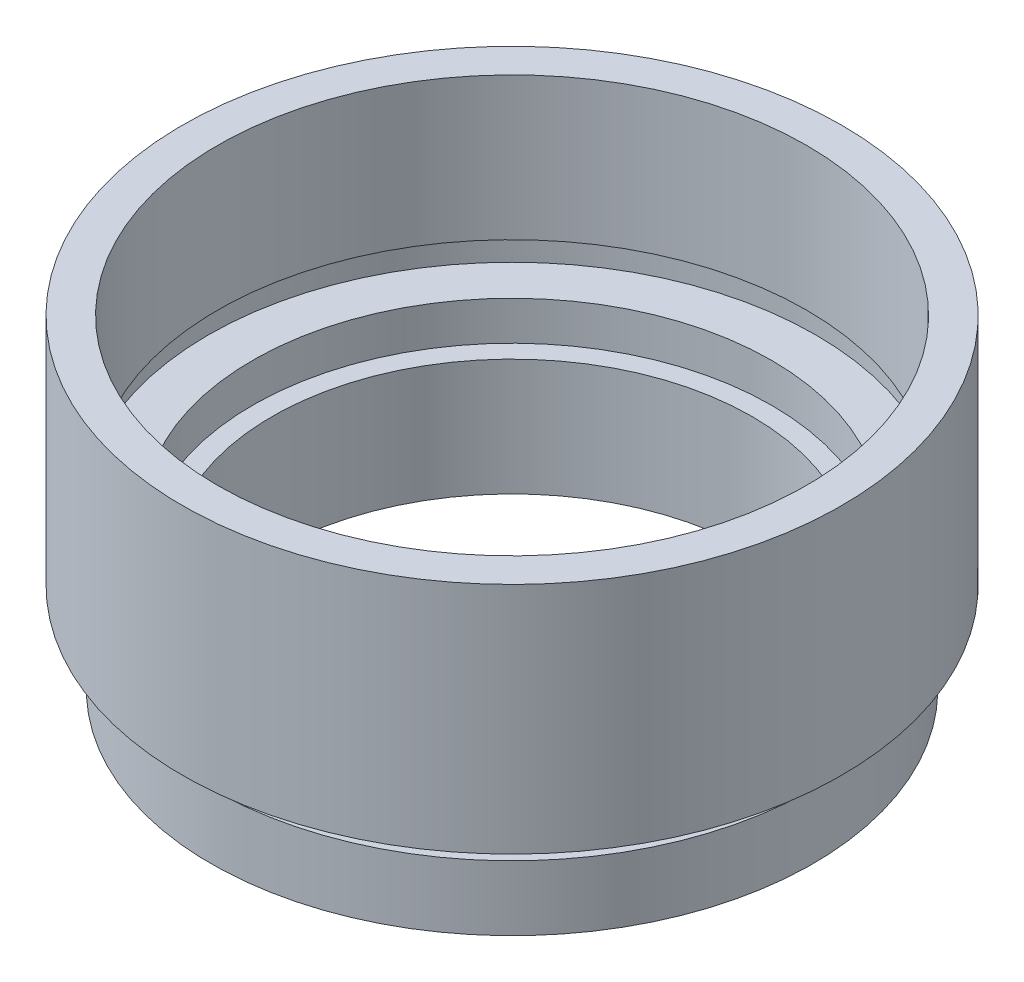
ISO-10303-21;
HEADER;
FILE_DESCRIPTION(('STEP AP214'),'2;1');
FILE_NAME('part.step','',(''),(''),'','','');
FILE_SCHEMA(('AUTOMOTIVE_DESIGN { 1 0 10303 214 1 1 1 1 }'));
ENDSEC;
DATA;
#1=APPLICATION_CONTEXT('core data for automotive mechanical design processes');
#2=APPLICATION_PROTOCOL_DEFINITION('international standard','automotive_design',2000,#1);
#3=PRODUCT_CONTEXT('',#1,'mechanical');
#4=PRODUCT('Part','Part','',(#3));
#5=PRODUCT_RELATED_PRODUCT_CATEGORY('part','',(#4));
#6=PRODUCT_DEFINITION_FORMATION('','',#4);
#7=PRODUCT_DEFINITION_CONTEXT('part definition',#1,'design');
#8=PRODUCT_DEFINITION('design','',#6,#7);
#9=PRODUCT_DEFINITION_SHAPE('','',#8);
#10=(LENGTH_UNIT() NAMED_UNIT(*) SI_UNIT(.MILLI.,.METRE.));
#11=(NAMED_UNIT(*) PLANE_ANGLE_UNIT() SI_UNIT($,.RADIAN.));
#12=(NAMED_UNIT(*) SI_UNIT($,.STERADIAN.) SOLID_ANGLE_UNIT());
#13=UNCERTAINTY_MEASURE_WITH_UNIT(LENGTH_MEASURE(1.E-05),#10,'distance_accuracy_value','');
#14=(GEOMETRIC_REPRESENTATION_CONTEXT(3) GLOBAL_UNCERTAINTY_ASSIGNED_CONTEXT((#13)) GLOBAL_UNIT_ASSIGNED_CONTEXT((#10,
#11,#12)) REPRESENTATION_CONTEXT('',''));
#15=CARTESIAN_POINT('',(0.,0.,0.));
#16=DIRECTION('',(0.,0.,1.));
#17=DIRECTION('',(1.,0.,0.));
#18=AXIS2_PLACEMENT_3D('',#15,#16,#17);
#19=CARTESIAN_POINT('',(0.,0.,0.));
#20=DIRECTION('',(0.,-1.,0.));
#21=DIRECTION('',(0.,0.,-1.));
#22=AXIS2_PLACEMENT_3D('',#19,#20,#21);
#23=CYLINDRICAL_SURFACE('',#22,9.25);
#24=CARTESIAN_POINT('',(0.,0.,0.));
#25=DIRECTION('',(0.,-1.,0.));
#26=DIRECTION('',(0.,0.,-1.));
#27=AXIS2_PLACEMENT_3D('',#24,#25,#26);
#28=CIRCLE('',#27,9.25);
#29=CARTESIAN_POINT('',(0.,0.,-9.25));
#30=VERTEX_POINT('',#29);
#31=EDGE_CURVE('E10',#30,#30,#28,.T.);
#32=ORIENTED_EDGE('',*,*,#31,.T.);
#33=EDGE_LOOP('',(#32));
#34=FACE_BOUND('',#33,.T.);
#35=CARTESIAN_POINT('',(0.,4.5,0.));
#36=DIRECTION('',(0.,-1.,0.));
#37=DIRECTION('',(0.,0.,-1.));
#38=AXIS2_PLACEMENT_3D('',#35,#36,#37);
#39=CIRCLE('',#38,9.25);
#40=CARTESIAN_POINT('',(0.,4.5,-9.25));
#41=VERTEX_POINT('',#40);
#42=EDGE_CURVE('E80',#41,#41,#39,.T.);
#43=ORIENTED_EDGE('',*,*,#42,.F.);
#44=EDGE_LOOP('',(#43));
#45=FACE_BOUND('',#44,.T.);
#46=ADVANCED_FACE('F34',(#34,#45),#23,.F.);
#47=CARTESIAN_POINT('',(9.25,0.,0.));
#48=DIRECTION('',(0.,-1.,0.));
#49=DIRECTION('',(0.,0.,-1.));
#50=AXIS2_PLACEMENT_3D('',#47,#48,#49);
#51=PLANE('',#50);
#52=CARTESIAN_POINT('',(0.,0.,0.));
#53=DIRECTION('',(0.,-1.,0.));
#54=DIRECTION('',(0.,0.,-1.));
#55=AXIS2_PLACEMENT_3D('',#52,#53,#54);
#56=CIRCLE('',#55,11.6);
#57=CARTESIAN_POINT('',(0.,0.,-11.6));
#58=VERTEX_POINT('',#57);
#59=EDGE_CURVE('E40',#58,#58,#56,.T.);
#60=ORIENTED_EDGE('',*,*,#59,.T.);
#61=EDGE_LOOP('',(#60));
#62=FACE_BOUND('',#61,.T.);
#63=ORIENTED_EDGE('',*,*,#31,.F.);
#64=EDGE_LOOP('',(#63));
#65=FACE_BOUND('',#64,.T.);
#66=ADVANCED_FACE('F88',(#62,#65),#51,.T.);
#67=CARTESIAN_POINT('',(0.,0.,0.));
#68=DIRECTION('',(0.,-1.,0.));
#69=DIRECTION('',(0.,0.,-1.));
#70=AXIS2_PLACEMENT_3D('',#67,#68,#69);
#71=CYLINDRICAL_SURFACE('',#70,11.6);
#72=CARTESIAN_POINT('',(0.,2.5,0.));
#73=DIRECTION('',(0.,-1.,0.));
#74=DIRECTION('',(0.,0.,-1.));
#75=AXIS2_PLACEMENT_3D('',#72,#73,#74);
#76=CIRCLE('',#75,11.6);
#77=CARTESIAN_POINT('',(0.,2.5,-11.6));
#78=VERTEX_POINT('',#77);
#79=EDGE_CURVE('E44',#78,#78,#76,.T.);
#80=ORIENTED_EDGE('',*,*,#79,.T.);
#81=EDGE_LOOP('',(#80));
#82=FACE_BOUND('',#81,.T.);
#83=ORIENTED_EDGE('',*,*,#59,.F.);
#84=EDGE_LOOP('',(#83));
#85=FACE_BOUND('',#84,.T.);
#86=ADVANCED_FACE('F92',(#82,#85),#71,.T.);
#87=CARTESIAN_POINT('',(11.6,2.5,0.));
#88=DIRECTION('',(0.,1.,0.));
#89=DIRECTION('',(0.,0.,1.));
#90=AXIS2_PLACEMENT_3D('',#87,#88,#89);
#91=PLANE('',#90);
#92=CARTESIAN_POINT('',(0.,2.5,0.));
#93=DIRECTION('',(0.,-1.,0.));
#94=DIRECTION('',(0.,0.,-1.));
#95=AXIS2_PLACEMENT_3D('',#92,#93,#94);
#96=CIRCLE('',#95,11.1);
#97=CARTESIAN_POINT('',(0.,2.5,-11.1));
#98=VERTEX_POINT('',#97);
#99=EDGE_CURVE('E48',#98,#98,#96,.T.);
#100=ORIENTED_EDGE('',*,*,#99,.T.);
#101=EDGE_LOOP('',(#100));
#102=FACE_BOUND('',#101,.T.);
#103=ORIENTED_EDGE('',*,*,#79,.F.);
#104=EDGE_LOOP('',(#103));
#105=FACE_BOUND('',#104,.T.);
#106=ADVANCED_FACE('F96',(#102,#105),#91,.T.);
#107=CARTESIAN_POINT('',(0.,0.,0.));
#108=DIRECTION('',(0.,-1.,0.));
#109=DIRECTION('',(0.,0.,-1.));
#110=AXIS2_PLACEMENT_3D('',#107,#108,#109);
#111=CYLINDRICAL_SURFACE('',#110,11.1);
#112=CARTESIAN_POINT('',(0.,3.5,0.));
#113=DIRECTION('',(0.,-1.,0.));
#114=DIRECTION('',(0.,0.,-1.));
#115=AXIS2_PLACEMENT_3D('',#112,#113,#114);
#116=CIRCLE('',#115,11.1);
#117=CARTESIAN_POINT('',(0.,3.5,-11.1));
#118=VERTEX_POINT('',#117);
#119=EDGE_CURVE('E53',#118,#118,#116,.T.);
#120=ORIENTED_EDGE('',*,*,#119,.T.);
#121=EDGE_LOOP('',(#120));
#122=FACE_BOUND('',#121,.T.);
#123=ORIENTED_EDGE('',*,*,#99,.F.);
#124=EDGE_LOOP('',(#123));
#125=FACE_BOUND('',#124,.T.);
#126=ADVANCED_FACE('F103',(#122,#125),#111,.T.);
#127=CARTESIAN_POINT('',(11.1,3.5,0.));
#128=DIRECTION('',(0.,-1.,0.));
#129=DIRECTION('',(0.,0.,-1.));
#130=AXIS2_PLACEMENT_3D('',#127,#128,#129);
#131=PLANE('',#130);
#132=CARTESIAN_POINT('',(0.,3.5,0.));
#133=DIRECTION('',(0.,-1.,0.));
#134=DIRECTION('',(0.,0.,-1.));
#135=AXIS2_PLACEMENT_3D('',#132,#133,#134);
#136=CIRCLE('',#135,12.7);
#137=CARTESIAN_POINT('',(0.,3.5,-12.7));
#138=VERTEX_POINT('',#137);
#139=EDGE_CURVE('E56',#138,#138,#136,.T.);
#140=ORIENTED_EDGE('',*,*,#139,.T.);
#141=EDGE_LOOP('',(#140));
#142=FACE_BOUND('',#141,.T.);
#143=ORIENTED_EDGE('',*,*,#119,.F.);
#144=EDGE_LOOP('',(#143));
#145=FACE_BOUND('',#144,.T.);
#146=ADVANCED_FACE('F107',(#142,#145),#131,.T.);
#147=CARTESIAN_POINT('',(0.,0.,0.));
#148=DIRECTION('',(0.,-1.,0.));
#149=DIRECTION('',(0.,0.,-1.));
#150=AXIS2_PLACEMENT_3D('',#147,#148,#149);
#151=CYLINDRICAL_SURFACE('',#150,12.7);
#152=CARTESIAN_POINT('',(0.,12.5,0.));
#153=DIRECTION('',(0.,-1.,0.));
#154=DIRECTION('',(0.,0.,-1.));
#155=AXIS2_PLACEMENT_3D('',#152,#153,#154);
#156=CIRCLE('',#155,12.7);
#157=CARTESIAN_POINT('',(0.,12.5,-12.7));
#158=VERTEX_POINT('',#157);
#159=EDGE_CURVE('E59',#158,#158,#156,.T.);
#160=ORIENTED_EDGE('',*,*,#159,.T.);
#161=EDGE_LOOP('',(#160));
#162=FACE_BOUND('',#161,.T.);
#163=ORIENTED_EDGE('',*,*,#139,.F.);
#164=EDGE_LOOP('',(#163));
#165=FACE_BOUND('',#164,.T.);
#166=ADVANCED_FACE('F111',(#162,#165),#151,.T.);
#167=CARTESIAN_POINT('',(12.7,12.5,0.));
#168=DIRECTION('',(0.,1.,0.));
#169=DIRECTION('',(0.,0.,1.));
#170=AXIS2_PLACEMENT_3D('',#167,#168,#169);
#171=PLANE('',#170);
#172=CARTESIAN_POINT('',(0.,12.5,0.));
#173=DIRECTION('',(0.,-1.,0.));
#174=DIRECTION('',(0.,0.,-1.));
#175=AXIS2_PLACEMENT_3D('',#172,#173,#174);
#176=CIRCLE('',#175,11.35);
#177=CARTESIAN_POINT('',(0.,12.5,-11.35));
#178=VERTEX_POINT('',#177);
#179=EDGE_CURVE('E62',#178,#178,#176,.T.);
#180=ORIENTED_EDGE('',*,*,#179,.T.);
#181=EDGE_LOOP('',(#180));
#182=FACE_BOUND('',#181,.T.);
#183=ORIENTED_EDGE('',*,*,#159,.F.);
#184=EDGE_LOOP('',(#183));
#185=FACE_BOUND('',#184,.T.);
#186=ADVANCED_FACE('F115',(#182,#185),#171,.T.);
#187=CARTESIAN_POINT('',(0.,0.,0.));
#188=DIRECTION('',(0.,-1.,0.));
#189=DIRECTION('',(0.,0.,-1.));
#190=AXIS2_PLACEMENT_3D('',#187,#188,#189);
#191=CYLINDRICAL_SURFACE('',#190,11.35);
#192=CARTESIAN_POINT('',(0.,7.,0.));
#193=DIRECTION('',(0.,-1.,0.));
#194=DIRECTION('',(0.,0.,-1.));
#195=AXIS2_PLACEMENT_3D('',#192,#193,#194);
#196=CIRCLE('',#195,11.35);
#197=CARTESIAN_POINT('',(0.,7.,-11.35));
#198=VERTEX_POINT('',#197);
#199=EDGE_CURVE('E65',#198,#198,#196,.T.);
#200=ORIENTED_EDGE('',*,*,#199,.T.);
#201=EDGE_LOOP('',(#200));
#202=FACE_BOUND('',#201,.T.);
#203=ORIENTED_EDGE('',*,*,#179,.F.);
#204=EDGE_LOOP('',(#203));
#205=FACE_BOUND('',#204,.T.);
#206=ADVANCED_FACE('F119',(#202,#205),#191,.F.);
#207=CARTESIAN_POINT('',(11.35,7.,0.));
#208=DIRECTION('',(0.,-1.,0.));
#209=DIRECTION('',(0.,0.,-1.));
#210=AXIS2_PLACEMENT_3D('',#207,#208,#209);
#211=PLANE('',#210);
#212=CARTESIAN_POINT('',(0.,7.,0.));
#213=DIRECTION('',(0.,-1.,0.));
#214=DIRECTION('',(0.,0.,-1.));
#215=AXIS2_PLACEMENT_3D('',#212,#213,#214);
#216=CIRCLE('',#215,11.7);
#217=CARTESIAN_POINT('',(0.,7.,-11.7));
#218=VERTEX_POINT('',#217);
#219=EDGE_CURVE('E68',#218,#218,#216,.T.);
#220=ORIENTED_EDGE('',*,*,#219,.T.);
#221=EDGE_LOOP('',(#220));
#222=FACE_BOUND('',#221,.T.);
#223=ORIENTED_EDGE('',*,*,#199,.F.);
#224=EDGE_LOOP('',(#223));
#225=FACE_BOUND('',#224,.T.);
#226=ADVANCED_FACE('F123',(#222,#225),#211,.T.);
#227=CARTESIAN_POINT('',(0.,0.,0.));
#228=DIRECTION('',(0.,-1.,0.));
#229=DIRECTION('',(0.,0.,-1.));
#230=AXIS2_PLACEMENT_3D('',#227,#228,#229);
#231=CYLINDRICAL_SURFACE('',#230,11.7);
#232=CARTESIAN_POINT('',(0.,6.,0.));
#233=DIRECTION('',(0.,-1.,0.));
#234=DIRECTION('',(0.,0.,-1.));
#235=AXIS2_PLACEMENT_3D('',#232,#233,#234);
#236=CIRCLE('',#235,11.7);
#237=CARTESIAN_POINT('',(0.,6.,-11.7));
#238=VERTEX_POINT('',#237);
#239=EDGE_CURVE('E71',#238,#238,#236,.T.);
#240=ORIENTED_EDGE('',*,*,#239,.T.);
#241=EDGE_LOOP('',(#240));
#242=FACE_BOUND('',#241,.T.);
#243=ORIENTED_EDGE('',*,*,#219,.F.);
#244=EDGE_LOOP('',(#243));
#245=FACE_BOUND('',#244,.T.);
#246=ADVANCED_FACE('F127',(#242,#245),#231,.F.);
#247=CARTESIAN_POINT('',(11.7,6.,0.));
#248=DIRECTION('',(0.,1.,0.));
#249=DIRECTION('',(0.,0.,1.));
#250=AXIS2_PLACEMENT_3D('',#247,#248,#249);
#251=PLANE('',#250);
#252=CARTESIAN_POINT('',(0.,6.,0.));
#253=DIRECTION('',(0.,-1.,0.));
#254=DIRECTION('',(0.,0.,-1.));
#255=AXIS2_PLACEMENT_3D('',#252,#253,#254);
#256=CIRCLE('',#255,10.);
#257=CARTESIAN_POINT('',(0.,6.,-10.));
#258=VERTEX_POINT('',#257);
#259=EDGE_CURVE('E74',#258,#258,#256,.T.);
#260=ORIENTED_EDGE('',*,*,#259,.T.);
#261=EDGE_LOOP('',(#260));
#262=FACE_BOUND('',#261,.T.);
#263=ORIENTED_EDGE('',*,*,#239,.F.);
#264=EDGE_LOOP('',(#263));
#265=FACE_BOUND('',#264,.T.);
#266=ADVANCED_FACE('F131',(#262,#265),#251,.T.);
#267=CARTESIAN_POINT('',(0.,0.,0.));
#268=DIRECTION('',(0.,-1.,0.));
#269=DIRECTION('',(0.,0.,-1.));
#270=AXIS2_PLACEMENT_3D('',#267,#268,#269);
#271=CYLINDRICAL_SURFACE('',#270,10.);
#272=CARTESIAN_POINT('',(0.,4.5,0.));
#273=DIRECTION('',(0.,-1.,0.));
#274=DIRECTION('',(0.,0.,-1.));
#275=AXIS2_PLACEMENT_3D('',#272,#273,#274);
#276=CIRCLE('',#275,10.);
#277=CARTESIAN_POINT('',(0.,4.5,-10.));
#278=VERTEX_POINT('',#277);
#279=EDGE_CURVE('E77',#278,#278,#276,.T.);
#280=ORIENTED_EDGE('',*,*,#279,.T.);
#281=EDGE_LOOP('',(#280));
#282=FACE_BOUND('',#281,.T.);
#283=ORIENTED_EDGE('',*,*,#259,.F.);
#284=EDGE_LOOP('',(#283));
#285=FACE_BOUND('',#284,.T.);
#286=ADVANCED_FACE('F135',(#282,#285),#271,.F.);
#287=CARTESIAN_POINT('',(10.,4.5,0.));
#288=DIRECTION('',(0.,1.,0.));
#289=DIRECTION('',(0.,0.,1.));
#290=AXIS2_PLACEMENT_3D('',#287,#288,#289);
#291=PLANE('',#290);
#292=ORIENTED_EDGE('',*,*,#42,.T.);
#293=EDGE_LOOP('',(#292));
#294=FACE_BOUND('',#293,.T.);
#295=ORIENTED_EDGE('',*,*,#279,.F.);
#296=EDGE_LOOP('',(#295));
#297=FACE_BOUND('',#296,.T.);
#298=ADVANCED_FACE('F84',(#294,#297),#291,.T.);
#299=CLOSED_SHELL('',(#46,#66,#86,#106,#126,#146,#166,#186,#206,#226,#246,#266,#286,#298));
#300=MANIFOLD_SOLID_BREP('B2',#299);
#301=ADVANCED_BREP_SHAPE_REPRESENTATION('',(#18,#300),#14);
#302=SHAPE_DEFINITION_REPRESENTATION(#9,#301);
ENDSEC;
END-ISO-10303-21;
